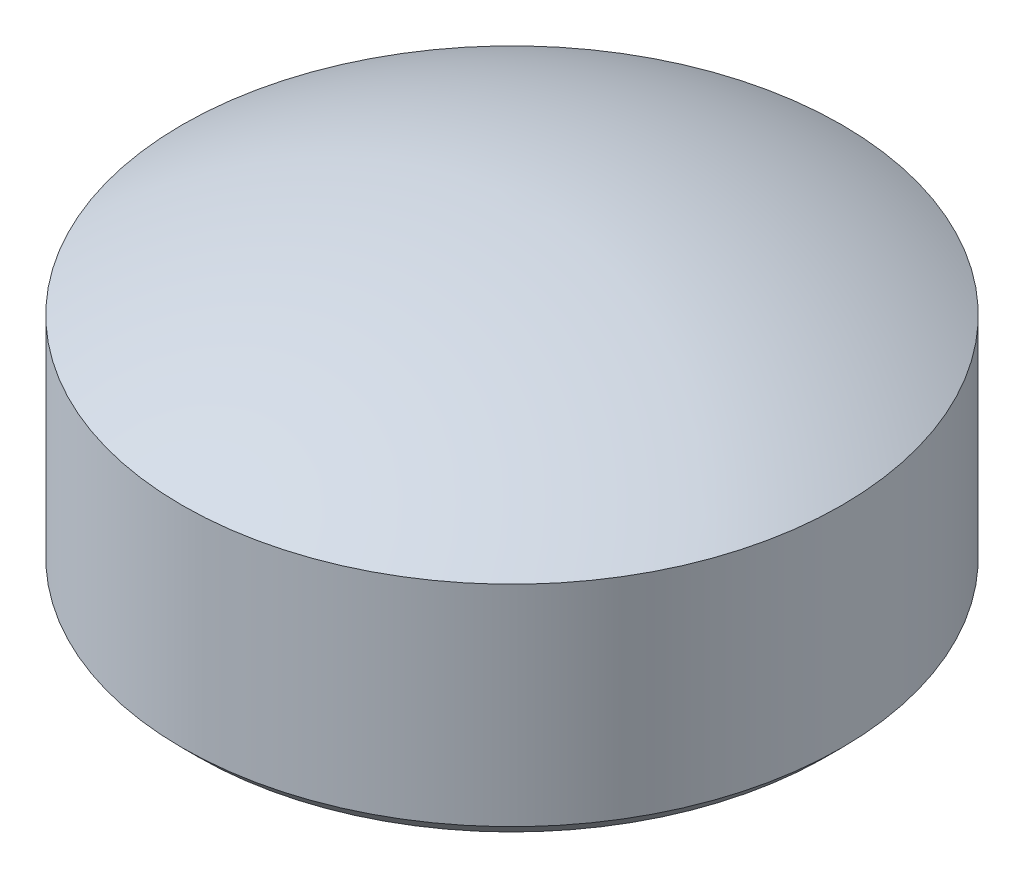
ISO-10303-21;
HEADER;
FILE_DESCRIPTION(('STEP AP214'),'2;1');
FILE_NAME('part.step','',(''),(''),'','','');
FILE_SCHEMA(('AUTOMOTIVE_DESIGN { 1 0 10303 214 1 1 1 1 }'));
ENDSEC;
DATA;
#1=APPLICATION_CONTEXT('core data for automotive mechanical design processes');
#2=APPLICATION_PROTOCOL_DEFINITION('international standard','automotive_design',2000,#1);
#3=PRODUCT_CONTEXT('',#1,'mechanical');
#4=PRODUCT('Part','Part','',(#3));
#5=PRODUCT_RELATED_PRODUCT_CATEGORY('part','',(#4));
#6=PRODUCT_DEFINITION_FORMATION('','',#4);
#7=PRODUCT_DEFINITION_CONTEXT('part definition',#1,'design');
#8=PRODUCT_DEFINITION('design','',#6,#7);
#9=PRODUCT_DEFINITION_SHAPE('','',#8);
#10=(LENGTH_UNIT() NAMED_UNIT(*) SI_UNIT(.MILLI.,.METRE.));
#11=(NAMED_UNIT(*) PLANE_ANGLE_UNIT() SI_UNIT($,.RADIAN.));
#12=(NAMED_UNIT(*) SI_UNIT($,.STERADIAN.) SOLID_ANGLE_UNIT());
#13=UNCERTAINTY_MEASURE_WITH_UNIT(LENGTH_MEASURE(1.E-05),#10,'distance_accuracy_value','');
#14=(GEOMETRIC_REPRESENTATION_CONTEXT(3) GLOBAL_UNCERTAINTY_ASSIGNED_CONTEXT((#13)) GLOBAL_UNIT_ASSIGNED_CONTEXT((#10,
#11,#12)) REPRESENTATION_CONTEXT('',''));
#15=CARTESIAN_POINT('',(0.,0.,0.));
#16=DIRECTION('',(0.,0.,1.));
#17=DIRECTION('',(1.,0.,0.));
#18=AXIS2_PLACEMENT_3D('',#15,#16,#17);
#19=CARTESIAN_POINT('',(0.,10.,0.));
#20=DIRECTION('',(0.,-1.,0.));
#21=DIRECTION('',(0.,0.,-1.));
#22=AXIS2_PLACEMENT_3D('',#19,#20,#21);
#23=CYLINDRICAL_SURFACE('',#22,10.5);
#24=CARTESIAN_POINT('',(0.,0.500000000000007,0.));
#25=DIRECTION('',(0.,1.,0.));
#26=DIRECTION('',(0.,0.,1.));
#27=AXIS2_PLACEMENT_3D('',#24,#25,#26);
#28=CIRCLE('',#27,10.5);
#29=CARTESIAN_POINT('',(0.,0.500000000000007,10.5));
#30=VERTEX_POINT('',#29);
#31=EDGE_CURVE('E42',#30,#30,#28,.T.);
#32=ORIENTED_EDGE('',*,*,#31,.T.);
#33=EDGE_LOOP('',(#32));
#34=FACE_BOUND('',#33,.T.);
#35=CARTESIAN_POINT('',(0.,7.18653347947321,0.));
#36=DIRECTION('',(0.,-1.,0.));
#37=DIRECTION('',(0.,0.,-1.));
#38=AXIS2_PLACEMENT_3D('',#35,#36,#37);
#39=CIRCLE('',#38,10.5);
#40=CARTESIAN_POINT('',(0.,7.18653347947321,-10.5));
#41=VERTEX_POINT('',#40);
#42=EDGE_CURVE('E46',#41,#41,#39,.T.);
#43=ORIENTED_EDGE('',*,*,#42,.T.);
#44=EDGE_LOOP('',(#43));
#45=FACE_BOUND('',#44,.T.);
#46=ADVANCED_FACE('F34',(#34,#45),#23,.T.);
#47=CARTESIAN_POINT('',(0.,-11.,0.));
#48=DIRECTION('',(0.,1.,0.));
#49=DIRECTION('',(1.,0.,0.));
#50=AXIS2_PLACEMENT_3D('',#47,#48,#49);
#51=SPHERICAL_SURFACE('',#50,21.);
#52=ORIENTED_EDGE('',*,*,#42,.F.);
#53=EDGE_LOOP('',(#52));
#54=FACE_BOUND('',#53,.T.);
#55=ADVANCED_FACE('F54',(#54),#51,.T.);
#56=CARTESIAN_POINT('',(0.,0.,0.));
#57=DIRECTION('',(0.,1.,0.));
#58=DIRECTION('',(0.,0.,1.));
#59=AXIS2_PLACEMENT_3D('',#56,#57,#58);
#60=PLANE('',#59);
#61=CARTESIAN_POINT('',(0.,0.,0.));
#62=DIRECTION('',(0.,1.,0.));
#63=DIRECTION('',(0.,0.,1.));
#64=AXIS2_PLACEMENT_3D('',#61,#62,#63);
#65=CIRCLE('',#64,9.99999999999999);
#66=CARTESIAN_POINT('',(0.,0.,9.99999999999999));
#67=VERTEX_POINT('',#66);
#68=EDGE_CURVE('E10',#67,#67,#65,.F.);
#69=ORIENTED_EDGE('',*,*,#68,.T.);
#70=EDGE_LOOP('',(#69));
#71=FACE_BOUND('',#70,.T.);
#72=ADVANCED_FACE('F56',(#71),#60,.F.);
#73=CARTESIAN_POINT('',(0.,0.500000000000007,0.));
#74=DIRECTION('',(0.,1.,0.));
#75=DIRECTION('',(0.,0.,1.));
#76=AXIS2_PLACEMENT_3D('',#73,#74,#75);
#77=CONICAL_SURFACE('',#76,10.5,0.785398163397448);
#78=ORIENTED_EDGE('',*,*,#68,.F.);
#79=EDGE_LOOP('',(#78));
#80=FACE_BOUND('',#79,.T.);
#81=ORIENTED_EDGE('',*,*,#31,.F.);
#82=EDGE_LOOP('',(#81));
#83=FACE_BOUND('',#82,.T.);
#84=ADVANCED_FACE('F37',(#80,#83),#77,.T.);
#85=CLOSED_SHELL('',(#46,#55,#72,#84));
#86=MANIFOLD_SOLID_BREP('B2',#85);
#87=ADVANCED_BREP_SHAPE_REPRESENTATION('',(#18,#86),#14);
#88=SHAPE_DEFINITION_REPRESENTATION(#9,#87);
ENDSEC;
END-ISO-10303-21;
